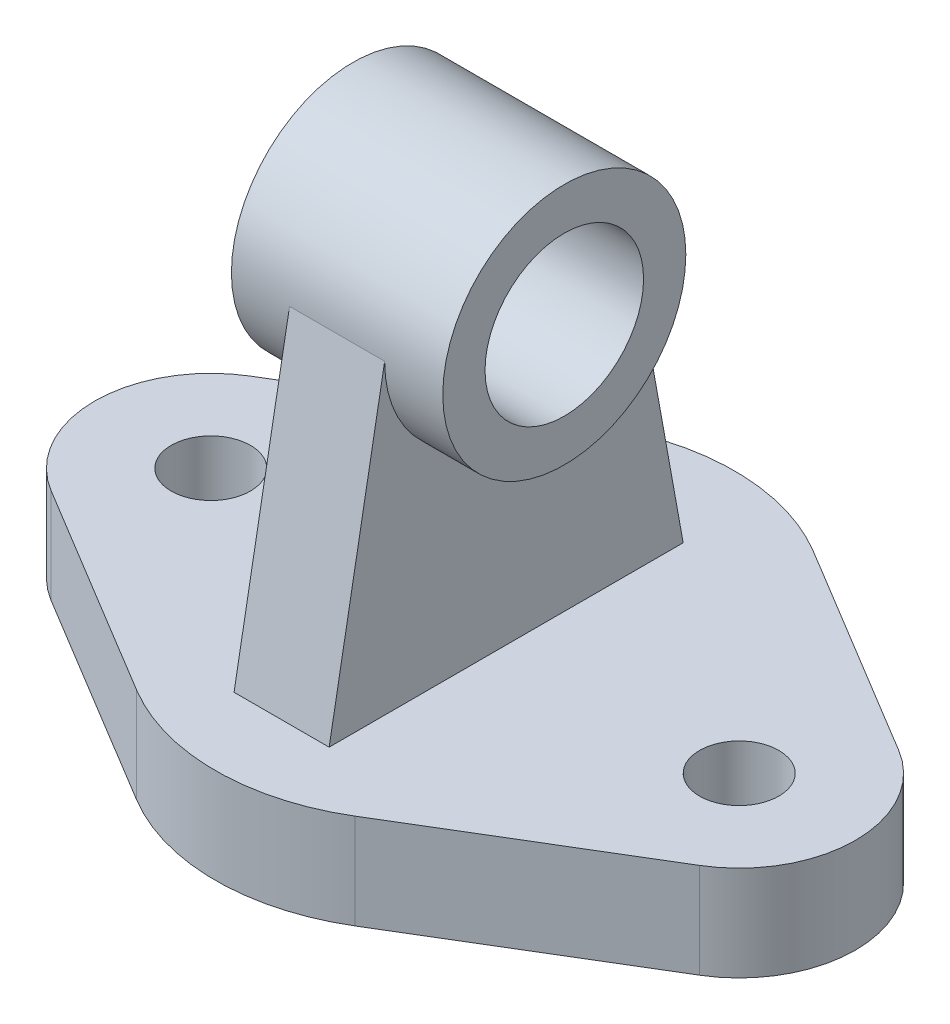
ISO-10303-21;
HEADER;
FILE_DESCRIPTION(('STEP AP214'),'2;1');
FILE_NAME('part.step','',(''),(''),'','','');
FILE_SCHEMA(('AUTOMOTIVE_DESIGN { 1 0 10303 214 1 1 1 1 }'));
ENDSEC;
DATA;
#1=APPLICATION_CONTEXT('core data for automotive mechanical design processes');
#2=APPLICATION_PROTOCOL_DEFINITION('international standard','automotive_design',2000,#1);
#3=PRODUCT_CONTEXT('',#1,'mechanical');
#4=PRODUCT('Part','Part','',(#3));
#5=PRODUCT_RELATED_PRODUCT_CATEGORY('part','',(#4));
#6=PRODUCT_DEFINITION_FORMATION('','',#4);
#7=PRODUCT_DEFINITION_CONTEXT('part definition',#1,'design');
#8=PRODUCT_DEFINITION('design','',#6,#7);
#9=PRODUCT_DEFINITION_SHAPE('','',#8);
#10=(LENGTH_UNIT() NAMED_UNIT(*) SI_UNIT(.MILLI.,.METRE.));
#11=(NAMED_UNIT(*) PLANE_ANGLE_UNIT() SI_UNIT($,.RADIAN.));
#12=(NAMED_UNIT(*) SI_UNIT($,.STERADIAN.) SOLID_ANGLE_UNIT());
#13=UNCERTAINTY_MEASURE_WITH_UNIT(LENGTH_MEASURE(1.E-05),#10,'distance_accuracy_value','');
#14=(GEOMETRIC_REPRESENTATION_CONTEXT(3) GLOBAL_UNCERTAINTY_ASSIGNED_CONTEXT((#13)) GLOBAL_UNIT_ASSIGNED_CONTEXT((#10,
#11,#12)) REPRESENTATION_CONTEXT('',''));
#15=CARTESIAN_POINT('',(0.,0.,0.));
#16=DIRECTION('',(0.,0.,1.));
#17=DIRECTION('',(1.,0.,0.));
#18=AXIS2_PLACEMENT_3D('',#15,#16,#17);
#19=CARTESIAN_POINT('',(0.,76.,0.507106684065645));
#20=DIRECTION('',(1.,0.,0.));
#21=DIRECTION('',(0.,0.,-1.));
#22=AXIS2_PLACEMENT_3D('',#19,#20,#21);
#23=PLANE('',#22);
#24=CARTESIAN_POINT('',(0.,76.,0.507106684065645));
#25=DIRECTION('',(-1.,0.,0.));
#26=DIRECTION('',(0.,0.,1.));
#27=AXIS2_PLACEMENT_3D('',#24,#25,#26);
#28=CIRCLE('',#27,23.);
#29=CARTESIAN_POINT('',(0.,76.,-22.4928933159344));
#30=VERTEX_POINT('',#29);
#31=CARTESIAN_POINT('',(0.,76.,23.5071066840656));
#32=VERTEX_POINT('',#31);
#33=EDGE_CURVE('E245',#30,#32,#28,.T.);
#34=ORIENTED_EDGE('',*,*,#33,.F.);
#35=DIRECTION('',(0.,0.984005351786824,0.178138899892442));
#36=VECTOR('',#35,1.);
#37=CARTESIAN_POINT('',(0.,76.,-22.4928933159344));
#38=LINE('',#37,#36);
#39=CARTESIAN_POINT('',(0.,18.,-32.9928933159344));
#40=VERTEX_POINT('',#39);
#41=EDGE_CURVE('E224',#40,#30,#38,.T.);
#42=ORIENTED_EDGE('',*,*,#41,.F.);
#43=DIRECTION('',(0.,0.,-1.));
#44=VECTOR('',#43,1.);
#45=CARTESIAN_POINT('',(0.,18.,-32.9928933159344));
#46=LINE('',#45,#44);
#47=CARTESIAN_POINT('',(0.,18.,34.0071066840656));
#48=VERTEX_POINT('',#47);
#49=EDGE_CURVE('E52',#48,#40,#46,.T.);
#50=ORIENTED_EDGE('',*,*,#49,.F.);
#51=DIRECTION('',(0.,-0.984005351786824,0.178138899892442));
#52=VECTOR('',#51,1.);
#53=CARTESIAN_POINT('',(0.,18.,34.0071066840656));
#54=LINE('',#53,#52);
#55=EDGE_CURVE('E221',#32,#48,#54,.T.);
#56=ORIENTED_EDGE('',*,*,#55,.F.);
#57=EDGE_LOOP('',(#34,#42,#50,#56));
#58=FACE_BOUND('',#57,.T.);
#59=ADVANCED_FACE('F37',(#58),#23,.F.);
#60=CARTESIAN_POINT('',(18.,76.,0.507106684065645));
#61=DIRECTION('',(1.,0.,0.));
#62=DIRECTION('',(0.,0.,-1.));
#63=AXIS2_PLACEMENT_3D('',#60,#61,#62);
#64=PLANE('',#63);
#65=DIRECTION('',(0.,0.984005351786824,0.178138899892442));
#66=VECTOR('',#65,1.);
#67=CARTESIAN_POINT('',(18.,76.,-22.4928933159344));
#68=LINE('',#67,#66);
#69=CARTESIAN_POINT('',(18.,18.,-32.9928933159344));
#70=VERTEX_POINT('',#69);
#71=CARTESIAN_POINT('',(18.,76.,-22.4928933159344));
#72=VERTEX_POINT('',#71);
#73=EDGE_CURVE('E231',#70,#72,#68,.T.);
#74=ORIENTED_EDGE('',*,*,#73,.T.);
#75=CARTESIAN_POINT('',(18.,76.,0.507106684065645));
#76=DIRECTION('',(1.,0.,0.));
#77=DIRECTION('',(0.,0.,-1.));
#78=AXIS2_PLACEMENT_3D('',#75,#76,#77);
#79=CIRCLE('',#78,23.);
#80=CARTESIAN_POINT('',(18.,76.,23.5071066840656));
#81=VERTEX_POINT('',#80);
#82=EDGE_CURVE('E236',#81,#72,#79,.T.);
#83=ORIENTED_EDGE('',*,*,#82,.F.);
#84=DIRECTION('',(0.,-0.984005351786824,0.178138899892442));
#85=VECTOR('',#84,1.);
#86=CARTESIAN_POINT('',(18.,18.,34.0071066840656));
#87=LINE('',#86,#85);
#88=CARTESIAN_POINT('',(18.,18.,34.0071066840656));
#89=VERTEX_POINT('',#88);
#90=EDGE_CURVE('E220',#81,#89,#87,.T.);
#91=ORIENTED_EDGE('',*,*,#90,.T.);
#92=DIRECTION('',(0.,0.,-1.));
#93=VECTOR('',#92,1.);
#94=CARTESIAN_POINT('',(18.,18.,-32.9928933159344));
#95=LINE('',#94,#93);
#96=EDGE_CURVE('E223',#89,#70,#95,.T.);
#97=ORIENTED_EDGE('',*,*,#96,.T.);
#98=EDGE_LOOP('',(#74,#83,#91,#97));
#99=FACE_BOUND('',#98,.T.);
#100=ADVANCED_FACE('F267',(#99),#64,.T.);
#101=CARTESIAN_POINT('',(11.0754953293639,18.,8.61192543828733));
#102=DIRECTION('',(0.,-1.,0.));
#103=DIRECTION('',(0.,0.,-1.));
#104=AXIS2_PLACEMENT_3D('',#101,#102,#103);
#105=PLANE('',#104);
#106=DIRECTION('',(-1.,0.,0.));
#107=VECTOR('',#106,1.);
#108=CARTESIAN_POINT('',(18.,18.,34.0071066840656));
#109=LINE('',#108,#107);
#110=EDGE_CURVE('E217',#89,#48,#109,.T.);
#111=ORIENTED_EDGE('',*,*,#110,.T.);
#112=ORIENTED_EDGE('',*,*,#49,.T.);
#113=DIRECTION('',(-1.,0.,0.));
#114=VECTOR('',#113,1.);
#115=CARTESIAN_POINT('',(18.,18.,-32.9928933159344));
#116=LINE('',#115,#114);
#117=EDGE_CURVE('E206',#70,#40,#116,.T.);
#118=ORIENTED_EDGE('',*,*,#117,.F.);
#119=ORIENTED_EDGE('',*,*,#96,.F.);
#120=EDGE_LOOP('',(#111,#112,#118,#119));
#121=FACE_BOUND('',#120,.T.);
#122=CARTESIAN_POINT('',(11.0754953293639,18.,8.61192543828733));
#123=DIRECTION('',(0.,1.,0.));
#124=DIRECTION('',(0.,0.,-1.));
#125=AXIS2_PLACEMENT_3D('',#122,#123,#124);
#126=CIRCLE('',#125,40.);
#127=CARTESIAN_POINT('',(-9.57944743327782,18.,42.86646294023));
#128=VERTEX_POINT('',#127);
#129=CARTESIAN_POINT('',(31.7304380920055,18.,42.86646294023));
#130=VERTEX_POINT('',#129);
#131=EDGE_CURVE('E163',#128,#130,#126,.T.);
#132=ORIENTED_EDGE('',*,*,#131,.T.);
#133=DIRECTION('',(0.856363437548567,0.,-0.516373569066042));
#134=VECTOR('',#133,1.);
#135=CARTESIAN_POINT('',(72.4357138488168,18.,18.3218273325591));
#136=LINE('',#135,#134);
#137=CARTESIAN_POINT('',(72.4357138488168,18.,18.3218273325591));
#138=VERTEX_POINT('',#137);
#139=EDGE_CURVE('E102',#130,#138,#136,.T.);
#140=ORIENTED_EDGE('',*,*,#139,.T.);
#141=CARTESIAN_POINT('',(61.0754953293639,18.,-0.518168293509437));
#142=DIRECTION('',(0.,1.,0.));
#143=DIRECTION('',(0.,0.,-1.));
#144=AXIS2_PLACEMENT_3D('',#141,#142,#143);
#145=CIRCLE('',#144,22.);
#146=CARTESIAN_POINT('',(72.4357138488168,18.,-19.3581639195779));
#147=VERTEX_POINT('',#146);
#148=EDGE_CURVE('E178',#138,#147,#145,.T.);
#149=ORIENTED_EDGE('',*,*,#148,.T.);
#150=DIRECTION('',(-0.856363437548567,0.,-0.516373569066042));
#151=VECTOR('',#150,1.);
#152=CARTESIAN_POINT('',(31.7304380920055,18.,-43.9027995272489));
#153=LINE('',#152,#151);
#154=CARTESIAN_POINT('',(31.7304380920055,18.,-43.9027995272489));
#155=VERTEX_POINT('',#154);
#156=EDGE_CURVE('E191',#147,#155,#153,.T.);
#157=ORIENTED_EDGE('',*,*,#156,.T.);
#158=CARTESIAN_POINT('',(11.0754953293639,18.,-9.64826202530618));
#159=DIRECTION('',(0.,1.,0.));
#160=DIRECTION('',(0.,0.,-1.));
#161=AXIS2_PLACEMENT_3D('',#158,#159,#160);
#162=CIRCLE('',#161,40.);
#163=CARTESIAN_POINT('',(-9.57944743327782,18.,-43.9027995272488));
#164=VERTEX_POINT('',#163);
#165=EDGE_CURVE('E126',#155,#164,#162,.T.);
#166=ORIENTED_EDGE('',*,*,#165,.T.);
#167=DIRECTION('',(-0.856363437548567,0.,0.516373569066042));
#168=VECTOR('',#167,1.);
#169=CARTESIAN_POINT('',(-50.2847231900891,18.,-19.3581639195779));
#170=LINE('',#169,#168);
#171=CARTESIAN_POINT('',(-50.2847231900891,18.,-19.3581639195779));
#172=VERTEX_POINT('',#171);
#173=EDGE_CURVE('E118',#164,#172,#170,.T.);
#174=ORIENTED_EDGE('',*,*,#173,.T.);
#175=CARTESIAN_POINT('',(-38.9245046706361,18.,-0.518168293509425));
#176=DIRECTION('',(0.,1.,0.));
#177=DIRECTION('',(0.,0.,1.));
#178=AXIS2_PLACEMENT_3D('',#175,#176,#177);
#179=CIRCLE('',#178,22.);
#180=CARTESIAN_POINT('',(-50.2847231900891,18.,18.321827332559));
#181=VERTEX_POINT('',#180);
#182=EDGE_CURVE('E123',#172,#181,#179,.T.);
#183=ORIENTED_EDGE('',*,*,#182,.T.);
#184=DIRECTION('',(0.856363437548567,0.,0.516373569066042));
#185=VECTOR('',#184,1.);
#186=CARTESIAN_POINT('',(-9.57944743327782,18.,42.86646294023));
#187=LINE('',#186,#185);
#188=EDGE_CURVE('E61',#181,#128,#187,.T.);
#189=ORIENTED_EDGE('',*,*,#188,.T.);
#190=EDGE_LOOP('',(#132,#140,#149,#157,#166,#174,#183,#189));
#191=FACE_BOUND('',#190,.T.);
#192=CARTESIAN_POINT('',(61.0754953293639,18.,-0.518168293509437));
#193=DIRECTION('',(0.,1.,0.));
#194=DIRECTION('',(0.,0.,1.));
#195=AXIS2_PLACEMENT_3D('',#192,#193,#194);
#196=CIRCLE('',#195,7.50000000000001);
#197=CARTESIAN_POINT('',(61.0754953293639,18.,6.98183170649057));
#198=VERTEX_POINT('',#197);
#199=EDGE_CURVE('E151',#198,#198,#196,.T.);
#200=ORIENTED_EDGE('',*,*,#199,.F.);
#201=EDGE_LOOP('',(#200));
#202=FACE_BOUND('',#201,.T.);
#203=CARTESIAN_POINT('',(-38.9245046706361,18.,-0.518168293509425));
#204=DIRECTION('',(0.,1.,0.));
#205=DIRECTION('',(0.,0.,1.));
#206=AXIS2_PLACEMENT_3D('',#203,#204,#205);
#207=CIRCLE('',#206,7.5);
#208=CARTESIAN_POINT('',(-38.9245046706361,18.,6.98183170649058));
#209=VERTEX_POINT('',#208);
#210=EDGE_CURVE('E200',#209,#209,#207,.T.);
#211=ORIENTED_EDGE('',*,*,#210,.F.);
#212=EDGE_LOOP('',(#211));
#213=FACE_BOUND('',#212,.T.);
#214=ADVANCED_FACE('F120',(#121,#191,#202,#213),#105,.F.);
#215=CARTESIAN_POINT('',(11.0754953293639,0.,8.61192543828733));
#216=DIRECTION('',(0.,-1.,0.));
#217=DIRECTION('',(0.,0.,-1.));
#218=AXIS2_PLACEMENT_3D('',#215,#216,#217);
#219=PLANE('',#218);
#220=CARTESIAN_POINT('',(61.0754953293639,0.,-0.518168293509437));
#221=DIRECTION('',(0.,1.,0.));
#222=DIRECTION('',(0.,0.,1.));
#223=AXIS2_PLACEMENT_3D('',#220,#221,#222);
#224=CIRCLE('',#223,7.50000000000001);
#225=CARTESIAN_POINT('',(61.0754953293639,0.,6.98183170649057));
#226=VERTEX_POINT('',#225);
#227=EDGE_CURVE('E197',#226,#226,#224,.T.);
#228=ORIENTED_EDGE('',*,*,#227,.T.);
#229=EDGE_LOOP('',(#228));
#230=FACE_BOUND('',#229,.T.);
#231=CARTESIAN_POINT('',(11.0754953293639,0.,8.61192543828733));
#232=DIRECTION('',(0.,1.,0.));
#233=DIRECTION('',(0.,0.,-1.));
#234=AXIS2_PLACEMENT_3D('',#231,#232,#233);
#235=CIRCLE('',#234,40.);
#236=CARTESIAN_POINT('',(-9.57944743327782,0.,42.86646294023));
#237=VERTEX_POINT('',#236);
#238=CARTESIAN_POINT('',(31.7304380920055,0.,42.86646294023));
#239=VERTEX_POINT('',#238);
#240=EDGE_CURVE('E147',#237,#239,#235,.T.);
#241=ORIENTED_EDGE('',*,*,#240,.F.);
#242=DIRECTION('',(0.856363437548567,0.,0.516373569066042));
#243=VECTOR('',#242,1.);
#244=CARTESIAN_POINT('',(-9.57944743327782,0.,42.86646294023));
#245=LINE('',#244,#243);
#246=CARTESIAN_POINT('',(-50.2847231900891,0.,18.321827332559));
#247=VERTEX_POINT('',#246);
#248=EDGE_CURVE('E94',#247,#237,#245,.T.);
#249=ORIENTED_EDGE('',*,*,#248,.F.);
#250=CARTESIAN_POINT('',(-38.9245046706361,0.,-0.518168293509425));
#251=DIRECTION('',(0.,1.,0.));
#252=DIRECTION('',(0.,0.,1.));
#253=AXIS2_PLACEMENT_3D('',#250,#251,#252);
#254=CIRCLE('',#253,22.);
#255=CARTESIAN_POINT('',(-50.2847231900891,0.,-19.3581639195779));
#256=VERTEX_POINT('',#255);
#257=EDGE_CURVE('E160',#256,#247,#254,.T.);
#258=ORIENTED_EDGE('',*,*,#257,.F.);
#259=DIRECTION('',(-0.856363437548567,0.,0.516373569066042));
#260=VECTOR('',#259,1.);
#261=CARTESIAN_POINT('',(-50.2847231900891,0.,-19.3581639195779));
#262=LINE('',#261,#260);
#263=CARTESIAN_POINT('',(-9.57944743327782,0.,-43.9027995272488));
#264=VERTEX_POINT('',#263);
#265=EDGE_CURVE('E135',#264,#256,#262,.T.);
#266=ORIENTED_EDGE('',*,*,#265,.F.);
#267=CARTESIAN_POINT('',(11.0754953293639,0.,-9.64826202530618));
#268=DIRECTION('',(0.,1.,0.));
#269=DIRECTION('',(0.,0.,-1.));
#270=AXIS2_PLACEMENT_3D('',#267,#268,#269);
#271=CIRCLE('',#270,40.);
#272=CARTESIAN_POINT('',(31.7304380920055,0.,-43.9027995272489));
#273=VERTEX_POINT('',#272);
#274=EDGE_CURVE('E157',#273,#264,#271,.T.);
#275=ORIENTED_EDGE('',*,*,#274,.F.);
#276=DIRECTION('',(-0.856363437548567,0.,-0.516373569066042));
#277=VECTOR('',#276,1.);
#278=CARTESIAN_POINT('',(31.7304380920055,0.,-43.9027995272489));
#279=LINE('',#278,#277);
#280=CARTESIAN_POINT('',(72.4357138488168,0.,-19.3581639195779));
#281=VERTEX_POINT('',#280);
#282=EDGE_CURVE('E155',#281,#273,#279,.T.);
#283=ORIENTED_EDGE('',*,*,#282,.F.);
#284=CARTESIAN_POINT('',(61.0754953293639,0.,-0.518168293509437));
#285=DIRECTION('',(0.,1.,0.));
#286=DIRECTION('',(0.,0.,-1.));
#287=AXIS2_PLACEMENT_3D('',#284,#285,#286);
#288=CIRCLE('',#287,22.);
#289=CARTESIAN_POINT('',(72.4357138488168,0.,18.3218273325591));
#290=VERTEX_POINT('',#289);
#291=EDGE_CURVE('E153',#290,#281,#288,.T.);
#292=ORIENTED_EDGE('',*,*,#291,.F.);
#293=DIRECTION('',(0.856363437548567,0.,-0.516373569066042));
#294=VECTOR('',#293,1.);
#295=CARTESIAN_POINT('',(72.4357138488168,0.,18.3218273325591));
#296=LINE('',#295,#294);
#297=EDGE_CURVE('E150',#239,#290,#296,.T.);
#298=ORIENTED_EDGE('',*,*,#297,.F.);
#299=EDGE_LOOP('',(#241,#249,#258,#266,#275,#283,#292,#298));
#300=FACE_BOUND('',#299,.T.);
#301=CARTESIAN_POINT('',(-38.9245046706361,0.,-0.518168293509425));
#302=DIRECTION('',(0.,1.,0.));
#303=DIRECTION('',(0.,0.,1.));
#304=AXIS2_PLACEMENT_3D('',#301,#302,#303);
#305=CIRCLE('',#304,7.5);
#306=CARTESIAN_POINT('',(-38.9245046706361,0.,6.98183170649058));
#307=VERTEX_POINT('',#306);
#308=EDGE_CURVE('E203',#307,#307,#305,.T.);
#309=ORIENTED_EDGE('',*,*,#308,.T.);
#310=EDGE_LOOP('',(#309));
#311=FACE_BOUND('',#310,.T.);
#312=ADVANCED_FACE('F182',(#230,#300,#311),#219,.T.);
#313=CARTESIAN_POINT('',(11.0754953293639,18.,8.61192543828733));
#314=DIRECTION('',(0.,-1.,0.));
#315=DIRECTION('',(0.,0.,-1.));
#316=AXIS2_PLACEMENT_3D('',#313,#314,#315);
#317=CYLINDRICAL_SURFACE('',#316,40.);
#318=ORIENTED_EDGE('',*,*,#240,.T.);
#319=DIRECTION('',(0.,-1.,0.));
#320=VECTOR('',#319,1.);
#321=CARTESIAN_POINT('',(31.7304380920055,18.,42.86646294023));
#322=LINE('',#321,#320);
#323=EDGE_CURVE('E11',#130,#239,#322,.T.);
#324=ORIENTED_EDGE('',*,*,#323,.F.);
#325=ORIENTED_EDGE('',*,*,#131,.F.);
#326=DIRECTION('',(0.,-1.,0.));
#327=VECTOR('',#326,1.);
#328=CARTESIAN_POINT('',(-9.57944743327782,18.,42.86646294023));
#329=LINE('',#328,#327);
#330=EDGE_CURVE('E143',#128,#237,#329,.T.);
#331=ORIENTED_EDGE('',*,*,#330,.T.);
#332=EDGE_LOOP('',(#318,#324,#325,#331));
#333=FACE_BOUND('',#332,.T.);
#334=ADVANCED_FACE('F39',(#333),#317,.T.);
#335=CARTESIAN_POINT('',(72.4357138488168,18.,18.3218273325591));
#336=DIRECTION('',(-0.516373569066042,0.,-0.856363437548567));
#337=DIRECTION('',(-0.856363437548567,0.,0.516373569066042));
#338=AXIS2_PLACEMENT_3D('',#335,#336,#337);
#339=PLANE('',#338);
#340=ORIENTED_EDGE('',*,*,#297,.T.);
#341=DIRECTION('',(0.,-1.,0.));
#342=VECTOR('',#341,1.);
#343=CARTESIAN_POINT('',(72.4357138488168,18.,18.3218273325591));
#344=LINE('',#343,#342);
#345=EDGE_CURVE('E45',#138,#290,#344,.T.);
#346=ORIENTED_EDGE('',*,*,#345,.F.);
#347=ORIENTED_EDGE('',*,*,#139,.F.);
#348=ORIENTED_EDGE('',*,*,#323,.T.);
#349=EDGE_LOOP('',(#340,#346,#347,#348));
#350=FACE_BOUND('',#349,.T.);
#351=ADVANCED_FACE('F315',(#350),#339,.F.);
#352=CARTESIAN_POINT('',(61.0754953293639,18.,-0.518168293509437));
#353=DIRECTION('',(0.,-1.,0.));
#354=DIRECTION('',(0.,0.,-1.));
#355=AXIS2_PLACEMENT_3D('',#352,#353,#354);
#356=CYLINDRICAL_SURFACE('',#355,22.);
#357=ORIENTED_EDGE('',*,*,#291,.T.);
#358=DIRECTION('',(0.,-1.,0.));
#359=VECTOR('',#358,1.);
#360=CARTESIAN_POINT('',(72.4357138488168,18.,-19.3581639195779));
#361=LINE('',#360,#359);
#362=EDGE_CURVE('E170',#147,#281,#361,.T.);
#363=ORIENTED_EDGE('',*,*,#362,.F.);
#364=ORIENTED_EDGE('',*,*,#148,.F.);
#365=ORIENTED_EDGE('',*,*,#345,.T.);
#366=EDGE_LOOP('',(#357,#363,#364,#365));
#367=FACE_BOUND('',#366,.T.);
#368=ADVANCED_FACE('F176',(#367),#356,.T.);
#369=CARTESIAN_POINT('',(31.7304380920055,18.,-43.9027995272489));
#370=DIRECTION('',(-0.516373569066042,0.,0.856363437548567));
#371=DIRECTION('',(0.856363437548567,0.,0.516373569066042));
#372=AXIS2_PLACEMENT_3D('',#369,#370,#371);
#373=PLANE('',#372);
#374=ORIENTED_EDGE('',*,*,#282,.T.);
#375=DIRECTION('',(0.,-1.,0.));
#376=VECTOR('',#375,1.);
#377=CARTESIAN_POINT('',(31.7304380920055,18.,-43.9027995272489));
#378=LINE('',#377,#376);
#379=EDGE_CURVE('E167',#155,#273,#378,.T.);
#380=ORIENTED_EDGE('',*,*,#379,.F.);
#381=ORIENTED_EDGE('',*,*,#156,.F.);
#382=ORIENTED_EDGE('',*,*,#362,.T.);
#383=EDGE_LOOP('',(#374,#380,#381,#382));
#384=FACE_BOUND('',#383,.T.);
#385=ADVANCED_FACE('F187',(#384),#373,.F.);
#386=CARTESIAN_POINT('',(11.0754953293639,18.,-9.64826202530618));
#387=DIRECTION('',(0.,-1.,0.));
#388=DIRECTION('',(0.,0.,-1.));
#389=AXIS2_PLACEMENT_3D('',#386,#387,#388);
#390=CYLINDRICAL_SURFACE('',#389,40.);
#391=ORIENTED_EDGE('',*,*,#274,.T.);
#392=DIRECTION('',(0.,-1.,0.));
#393=VECTOR('',#392,1.);
#394=CARTESIAN_POINT('',(-9.57944743327782,18.,-43.9027995272488));
#395=LINE('',#394,#393);
#396=EDGE_CURVE('E138',#164,#264,#395,.T.);
#397=ORIENTED_EDGE('',*,*,#396,.F.);
#398=ORIENTED_EDGE('',*,*,#165,.F.);
#399=ORIENTED_EDGE('',*,*,#379,.T.);
#400=EDGE_LOOP('',(#391,#397,#398,#399));
#401=FACE_BOUND('',#400,.T.);
#402=ADVANCED_FACE('F190',(#401),#390,.T.);
#403=CARTESIAN_POINT('',(-50.2847231900891,18.,-19.3581639195779));
#404=DIRECTION('',(0.516373569066042,0.,0.856363437548566));
#405=DIRECTION('',(0.856363437548567,0.,-0.516373569066042));
#406=AXIS2_PLACEMENT_3D('',#403,#404,#405);
#407=PLANE('',#406);
#408=ORIENTED_EDGE('',*,*,#265,.T.);
#409=DIRECTION('',(0.,-1.,0.));
#410=VECTOR('',#409,1.);
#411=CARTESIAN_POINT('',(-50.2847231900891,18.,-19.3581639195779));
#412=LINE('',#411,#410);
#413=EDGE_CURVE('E132',#172,#256,#412,.T.);
#414=ORIENTED_EDGE('',*,*,#413,.F.);
#415=ORIENTED_EDGE('',*,*,#173,.F.);
#416=ORIENTED_EDGE('',*,*,#396,.T.);
#417=EDGE_LOOP('',(#408,#414,#415,#416));
#418=FACE_BOUND('',#417,.T.);
#419=ADVANCED_FACE('F133',(#418),#407,.F.);
#420=CARTESIAN_POINT('',(-38.9245046706361,18.,-0.518168293509425));
#421=DIRECTION('',(0.,-1.,0.));
#422=DIRECTION('',(0.,0.,-1.));
#423=AXIS2_PLACEMENT_3D('',#420,#421,#422);
#424=CYLINDRICAL_SURFACE('',#423,22.);
#425=ORIENTED_EDGE('',*,*,#257,.T.);
#426=DIRECTION('',(0.,-1.,0.));
#427=VECTOR('',#426,1.);
#428=CARTESIAN_POINT('',(-50.2847231900891,18.,18.321827332559));
#429=LINE('',#428,#427);
#430=EDGE_CURVE('E139',#181,#247,#429,.T.);
#431=ORIENTED_EDGE('',*,*,#430,.F.);
#432=ORIENTED_EDGE('',*,*,#182,.F.);
#433=ORIENTED_EDGE('',*,*,#413,.T.);
#434=EDGE_LOOP('',(#425,#431,#432,#433));
#435=FACE_BOUND('',#434,.T.);
#436=ADVANCED_FACE('F141',(#435),#424,.T.);
#437=CARTESIAN_POINT('',(-9.57944743327782,18.,42.86646294023));
#438=DIRECTION('',(0.516373569066042,0.,-0.856363437548566));
#439=DIRECTION('',(-0.856363437548567,0.,-0.516373569066042));
#440=AXIS2_PLACEMENT_3D('',#437,#438,#439);
#441=PLANE('',#440);
#442=ORIENTED_EDGE('',*,*,#248,.T.);
#443=ORIENTED_EDGE('',*,*,#330,.F.);
#444=ORIENTED_EDGE('',*,*,#188,.F.);
#445=ORIENTED_EDGE('',*,*,#430,.T.);
#446=EDGE_LOOP('',(#442,#443,#444,#445));
#447=FACE_BOUND('',#446,.T.);
#448=ADVANCED_FACE('F296',(#447),#441,.F.);
#449=CARTESIAN_POINT('',(61.0754953293639,18.,-0.518168293509437));
#450=DIRECTION('',(0.,-1.,0.));
#451=DIRECTION('',(0.,0.,-1.));
#452=AXIS2_PLACEMENT_3D('',#449,#450,#451);
#453=CYLINDRICAL_SURFACE('',#452,7.50000000000001);
#454=ORIENTED_EDGE('',*,*,#199,.T.);
#455=EDGE_LOOP('',(#454));
#456=FACE_BOUND('',#455,.T.);
#457=ORIENTED_EDGE('',*,*,#227,.F.);
#458=EDGE_LOOP('',(#457));
#459=FACE_BOUND('',#458,.T.);
#460=ADVANCED_FACE('F292',(#456,#459),#453,.F.);
#461=CARTESIAN_POINT('',(-38.9245046706361,18.,-0.518168293509425));
#462=DIRECTION('',(0.,-1.,0.));
#463=DIRECTION('',(0.,0.,-1.));
#464=AXIS2_PLACEMENT_3D('',#461,#462,#463);
#465=CYLINDRICAL_SURFACE('',#464,7.5);
#466=ORIENTED_EDGE('',*,*,#210,.T.);
#467=EDGE_LOOP('',(#466));
#468=FACE_BOUND('',#467,.T.);
#469=ORIENTED_EDGE('',*,*,#308,.F.);
#470=EDGE_LOOP('',(#469));
#471=FACE_BOUND('',#470,.T.);
#472=ADVANCED_FACE('F288',(#468,#471),#465,.F.);
#473=CARTESIAN_POINT('',(18.,76.,-22.4928933159344));
#474=DIRECTION('',(0.,-0.178138899892442,0.984005351786823));
#475=DIRECTION('',(0.,-0.984005351786824,-0.178138899892442));
#476=AXIS2_PLACEMENT_3D('',#473,#474,#475);
#477=PLANE('',#476);
#478=ORIENTED_EDGE('',*,*,#41,.T.);
#479=DIRECTION('',(-1.,0.,0.));
#480=VECTOR('',#479,1.);
#481=CARTESIAN_POINT('',(18.,76.,-22.4928933159344));
#482=LINE('',#481,#480);
#483=EDGE_CURVE('E211',#72,#30,#482,.T.);
#484=ORIENTED_EDGE('',*,*,#483,.F.);
#485=ORIENTED_EDGE('',*,*,#73,.F.);
#486=ORIENTED_EDGE('',*,*,#117,.T.);
#487=EDGE_LOOP('',(#478,#484,#485,#486));
#488=FACE_BOUND('',#487,.T.);
#489=ADVANCED_FACE('F284',(#488),#477,.F.);
#490=CARTESIAN_POINT('',(18.,76.,0.507106684065645));
#491=DIRECTION('',(-1.,0.,0.));
#492=DIRECTION('',(0.,0.,1.));
#493=AXIS2_PLACEMENT_3D('',#490,#491,#492);
#494=CYLINDRICAL_SURFACE('',#493,23.);
#495=ORIENTED_EDGE('',*,*,#483,.T.);
#496=ORIENTED_EDGE('',*,*,#33,.T.);
#497=DIRECTION('',(-1.,0.,0.));
#498=VECTOR('',#497,1.);
#499=CARTESIAN_POINT('',(18.,76.,23.5071066840656));
#500=LINE('',#499,#498);
#501=EDGE_CURVE('E214',#81,#32,#500,.T.);
#502=ORIENTED_EDGE('',*,*,#501,.F.);
#503=ORIENTED_EDGE('',*,*,#82,.T.);
#504=EDGE_LOOP('',(#495,#496,#502,#503));
#505=FACE_BOUND('',#504,.T.);
#506=CARTESIAN_POINT('',(29.,76.,0.507106684065645));
#507=DIRECTION('',(1.,0.,0.));
#508=DIRECTION('',(0.,0.,-1.));
#509=AXIS2_PLACEMENT_3D('',#506,#507,#508);
#510=CIRCLE('',#509,23.);
#511=CARTESIAN_POINT('',(29.,76.,-22.4928933159344));
#512=VERTEX_POINT('',#511);
#513=EDGE_CURVE('E228',#512,#512,#510,.T.);
#514=ORIENTED_EDGE('',*,*,#513,.F.);
#515=EDGE_LOOP('',(#514));
#516=FACE_BOUND('',#515,.T.);
#517=CARTESIAN_POINT('',(-11.,76.,0.507106684065645));
#518=DIRECTION('',(-1.,0.,0.));
#519=DIRECTION('',(0.,0.,1.));
#520=AXIS2_PLACEMENT_3D('',#517,#518,#519);
#521=CIRCLE('',#520,23.);
#522=CARTESIAN_POINT('',(-11.,76.,23.5071066840656));
#523=VERTEX_POINT('',#522);
#524=EDGE_CURVE('E244',#523,#523,#521,.T.);
#525=ORIENTED_EDGE('',*,*,#524,.F.);
#526=EDGE_LOOP('',(#525));
#527=FACE_BOUND('',#526,.T.);
#528=ADVANCED_FACE('F280',(#505,#516,#527),#494,.T.);
#529=CARTESIAN_POINT('',(18.,18.,34.0071066840656));
#530=DIRECTION('',(0.,-0.178138899892442,-0.984005351786823));
#531=DIRECTION('',(0.,0.984005351786824,-0.178138899892442));
#532=AXIS2_PLACEMENT_3D('',#529,#530,#531);
#533=PLANE('',#532);
#534=ORIENTED_EDGE('',*,*,#55,.T.);
#535=ORIENTED_EDGE('',*,*,#110,.F.);
#536=ORIENTED_EDGE('',*,*,#90,.F.);
#537=ORIENTED_EDGE('',*,*,#501,.T.);
#538=EDGE_LOOP('',(#534,#535,#536,#537));
#539=FACE_BOUND('',#538,.T.);
#540=ADVANCED_FACE('F277',(#539),#533,.F.);
#541=CARTESIAN_POINT('',(18.,76.,0.507106684065645));
#542=DIRECTION('',(-1.,0.,0.));
#543=DIRECTION('',(0.,0.,1.));
#544=AXIS2_PLACEMENT_3D('',#541,#542,#543);
#545=CYLINDRICAL_SURFACE('',#544,15.);
#546=CARTESIAN_POINT('',(29.,76.,0.507106684065645));
#547=DIRECTION('',(1.,0.,0.));
#548=DIRECTION('',(0.,0.,-1.));
#549=AXIS2_PLACEMENT_3D('',#546,#547,#548);
#550=CIRCLE('',#549,15.);
#551=CARTESIAN_POINT('',(29.,76.,-14.4928933159344));
#552=VERTEX_POINT('',#551);
#553=EDGE_CURVE('E239',#552,#552,#550,.T.);
#554=ORIENTED_EDGE('',*,*,#553,.T.);
#555=EDGE_LOOP('',(#554));
#556=FACE_BOUND('',#555,.T.);
#557=CARTESIAN_POINT('',(-11.,76.,0.507106684065645));
#558=DIRECTION('',(-1.,0.,0.));
#559=DIRECTION('',(0.,0.,1.));
#560=AXIS2_PLACEMENT_3D('',#557,#558,#559);
#561=CIRCLE('',#560,15.);
#562=CARTESIAN_POINT('',(-11.,76.,15.5071066840656));
#563=VERTEX_POINT('',#562);
#564=EDGE_CURVE('E248',#563,#563,#561,.T.);
#565=ORIENTED_EDGE('',*,*,#564,.T.);
#566=EDGE_LOOP('',(#565));
#567=FACE_BOUND('',#566,.T.);
#568=ADVANCED_FACE('F254',(#556,#567),#545,.F.);
#569=CARTESIAN_POINT('',(29.,76.,0.507106684065645));
#570=DIRECTION('',(1.,0.,0.));
#571=DIRECTION('',(0.,0.,-1.));
#572=AXIS2_PLACEMENT_3D('',#569,#570,#571);
#573=PLANE('',#572);
#574=ORIENTED_EDGE('',*,*,#513,.T.);
#575=EDGE_LOOP('',(#574));
#576=FACE_BOUND('',#575,.T.);
#577=ORIENTED_EDGE('',*,*,#553,.F.);
#578=EDGE_LOOP('',(#577));
#579=FACE_BOUND('',#578,.T.);
#580=ADVANCED_FACE('F258',(#576,#579),#573,.T.);
#581=CARTESIAN_POINT('',(-11.,76.,0.507106684065645));
#582=DIRECTION('',(-1.,0.,0.));
#583=DIRECTION('',(0.,0.,1.));
#584=AXIS2_PLACEMENT_3D('',#581,#582,#583);
#585=PLANE('',#584);
#586=ORIENTED_EDGE('',*,*,#524,.T.);
#587=EDGE_LOOP('',(#586));
#588=FACE_BOUND('',#587,.T.);
#589=ORIENTED_EDGE('',*,*,#564,.F.);
#590=EDGE_LOOP('',(#589));
#591=FACE_BOUND('',#590,.T.);
#592=ADVANCED_FACE('F256',(#588,#591),#585,.T.);
#593=CLOSED_SHELL('',(#59,#100,#214,#312,#334,#351,#368,#385,#402,#419,#436,#448,#460,#472,#489,
#528,#540,#568,#580,#592));
#594=MANIFOLD_SOLID_BREP('B2',#593);
#595=ADVANCED_BREP_SHAPE_REPRESENTATION('',(#18,#594),#14);
#596=SHAPE_DEFINITION_REPRESENTATION(#9,#595);
ENDSEC;
END-ISO-10303-21;
